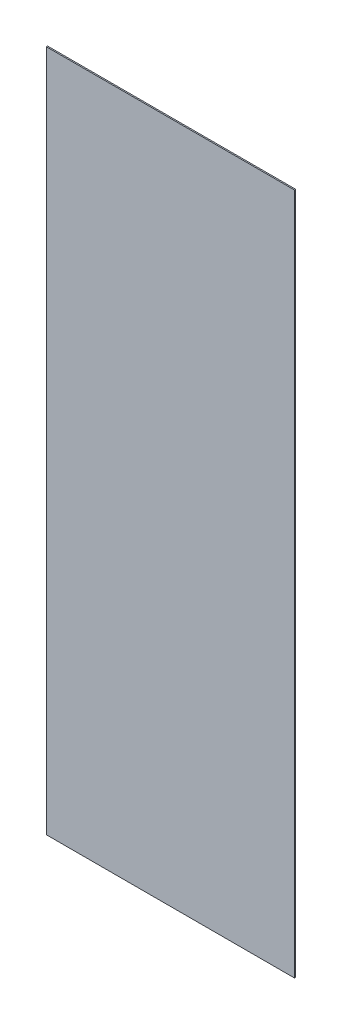
ISO-10303-21;
HEADER;
FILE_DESCRIPTION(('STEP AP214'),'2;1');
FILE_NAME('part.step','',(''),(''),'','','');
FILE_SCHEMA(('AUTOMOTIVE_DESIGN { 1 0 10303 214 1 1 1 1 }'));
ENDSEC;
DATA;
#1=APPLICATION_CONTEXT('core data for automotive mechanical design processes');
#2=APPLICATION_PROTOCOL_DEFINITION('international standard','automotive_design',2000,#1);
#3=PRODUCT_CONTEXT('',#1,'mechanical');
#4=PRODUCT('Part','Part','',(#3));
#5=PRODUCT_RELATED_PRODUCT_CATEGORY('part','',(#4));
#6=PRODUCT_DEFINITION_FORMATION('','',#4);
#7=PRODUCT_DEFINITION_CONTEXT('part definition',#1,'design');
#8=PRODUCT_DEFINITION('design','',#6,#7);
#9=PRODUCT_DEFINITION_SHAPE('','',#8);
#10=(LENGTH_UNIT() NAMED_UNIT(*) SI_UNIT(.MILLI.,.METRE.));
#11=(NAMED_UNIT(*) PLANE_ANGLE_UNIT() SI_UNIT($,.RADIAN.));
#12=(NAMED_UNIT(*) SI_UNIT($,.STERADIAN.) SOLID_ANGLE_UNIT());
#13=UNCERTAINTY_MEASURE_WITH_UNIT(LENGTH_MEASURE(1.E-05),#10,'distance_accuracy_value','');
#14=(GEOMETRIC_REPRESENTATION_CONTEXT(3) GLOBAL_UNCERTAINTY_ASSIGNED_CONTEXT((#13)) GLOBAL_UNIT_ASSIGNED_CONTEXT((#10,
#11,#12)) REPRESENTATION_CONTEXT('',''));
#15=CARTESIAN_POINT('',(0.,0.,0.));
#16=DIRECTION('',(0.,0.,1.));
#17=DIRECTION('',(1.,0.,0.));
#18=AXIS2_PLACEMENT_3D('',#15,#16,#17);
#19=CARTESIAN_POINT('',(2.5544535961954,-0.251849343952375,0.));
#20=DIRECTION('',(0.,1.,0.));
#21=DIRECTION('',(-1.,0.,0.));
#22=AXIS2_PLACEMENT_3D('',#19,#20,#21);
#23=PLANE('',#22);
#24=DIRECTION('',(1.,0.,0.));
#25=VECTOR('',#24,1.);
#26=CARTESIAN_POINT('',(2.5345236394027,-0.251849343952375,0.));
#27=LINE('',#26,#25);
#28=CARTESIAN_POINT('',(2.5345236394027,-0.251849343952375,0.));
#29=VERTEX_POINT('',#28);
#30=CARTESIAN_POINT('',(2.5544535961954,-0.251849343952375,0.));
#31=VERTEX_POINT('',#30);
#32=EDGE_CURVE('E11',#29,#31,#27,.T.);
#33=ORIENTED_EDGE('',*,*,#32,.F.);
#34=DIRECTION('',(0.,0.,1.));
#35=VECTOR('',#34,1.);
#36=CARTESIAN_POINT('',(2.5345236394027,-0.251849343952375,0.));
#37=LINE('',#36,#35);
#38=CARTESIAN_POINT('',(2.5345236394027,-0.251849343952375,0.0001));
#39=VERTEX_POINT('',#38);
#40=EDGE_CURVE('E24',#29,#39,#37,.T.);
#41=ORIENTED_EDGE('',*,*,#40,.T.);
#42=DIRECTION('',(-1.,0.,0.));
#43=VECTOR('',#42,1.);
#44=CARTESIAN_POINT('',(2.5345236394027,-0.251849343952375,0.0001));
#45=LINE('',#44,#43);
#46=CARTESIAN_POINT('',(2.5544535961954,-0.251849343952375,0.0001));
#47=VERTEX_POINT('',#46);
#48=EDGE_CURVE('E75',#47,#39,#45,.T.);
#49=ORIENTED_EDGE('',*,*,#48,.F.);
#50=DIRECTION('',(0.,0.,1.));
#51=VECTOR('',#50,1.);
#52=CARTESIAN_POINT('',(2.5544535961954,-0.251849343952375,0.));
#53=LINE('',#52,#51);
#54=EDGE_CURVE('E85',#31,#47,#53,.T.);
#55=ORIENTED_EDGE('',*,*,#54,.F.);
#56=EDGE_LOOP('',(#33,#41,#49,#55));
#57=FACE_BOUND('',#56,.T.);
#58=ADVANCED_FACE('F17',(#57),#23,.T.);
#59=CARTESIAN_POINT('',(2.5544535961954,-0.306666120864404,0.));
#60=DIRECTION('',(1.,0.,0.));
#61=DIRECTION('',(0.,1.,0.));
#62=AXIS2_PLACEMENT_3D('',#59,#60,#61);
#63=PLANE('',#62);
#64=DIRECTION('',(0.,-1.,0.));
#65=VECTOR('',#64,1.);
#66=CARTESIAN_POINT('',(2.5544535961954,-0.251849343952375,0.));
#67=LINE('',#66,#65);
#68=CARTESIAN_POINT('',(2.5544535961954,-0.306666120864404,0.));
#69=VERTEX_POINT('',#68);
#70=EDGE_CURVE('E83',#31,#69,#67,.T.);
#71=ORIENTED_EDGE('',*,*,#70,.F.);
#72=ORIENTED_EDGE('',*,*,#54,.T.);
#73=DIRECTION('',(0.,1.,0.));
#74=VECTOR('',#73,1.);
#75=CARTESIAN_POINT('',(2.5544535961954,-0.251849343952375,0.0001));
#76=LINE('',#75,#74);
#77=CARTESIAN_POINT('',(2.5544535961954,-0.306666120864404,0.0001));
#78=VERTEX_POINT('',#77);
#79=EDGE_CURVE('E81',#78,#47,#76,.T.);
#80=ORIENTED_EDGE('',*,*,#79,.F.);
#81=DIRECTION('',(0.,0.,1.));
#82=VECTOR('',#81,1.);
#83=CARTESIAN_POINT('',(2.5544535961954,-0.306666120864404,0.));
#84=LINE('',#83,#82);
#85=EDGE_CURVE('E61',#69,#78,#84,.T.);
#86=ORIENTED_EDGE('',*,*,#85,.F.);
#87=EDGE_LOOP('',(#71,#72,#80,#86));
#88=FACE_BOUND('',#87,.T.);
#89=ADVANCED_FACE('F91',(#88),#63,.T.);
#90=CARTESIAN_POINT('',(2.5345236394027,-0.306666120864404,0.));
#91=DIRECTION('',(0.,-1.,0.));
#92=DIRECTION('',(1.,0.,0.));
#93=AXIS2_PLACEMENT_3D('',#90,#91,#92);
#94=PLANE('',#93);
#95=DIRECTION('',(-1.,0.,0.));
#96=VECTOR('',#95,1.);
#97=CARTESIAN_POINT('',(2.5544535961954,-0.306666120864404,0.));
#98=LINE('',#97,#96);
#99=CARTESIAN_POINT('',(2.5345236394027,-0.306666120864404,0.));
#100=VERTEX_POINT('',#99);
#101=EDGE_CURVE('E65',#69,#100,#98,.T.);
#102=ORIENTED_EDGE('',*,*,#101,.F.);
#103=ORIENTED_EDGE('',*,*,#85,.T.);
#104=DIRECTION('',(1.,0.,0.));
#105=VECTOR('',#104,1.);
#106=CARTESIAN_POINT('',(2.5544535961954,-0.306666120864404,0.0001));
#107=LINE('',#106,#105);
#108=CARTESIAN_POINT('',(2.5345236394027,-0.306666120864404,0.0001));
#109=VERTEX_POINT('',#108);
#110=EDGE_CURVE('E54',#109,#78,#107,.T.);
#111=ORIENTED_EDGE('',*,*,#110,.F.);
#112=DIRECTION('',(0.,0.,1.));
#113=VECTOR('',#112,1.);
#114=CARTESIAN_POINT('',(2.5345236394027,-0.306666120864404,0.));
#115=LINE('',#114,#113);
#116=EDGE_CURVE('E58',#100,#109,#115,.T.);
#117=ORIENTED_EDGE('',*,*,#116,.F.);
#118=EDGE_LOOP('',(#102,#103,#111,#117));
#119=FACE_BOUND('',#118,.T.);
#120=ADVANCED_FACE('F57',(#119),#94,.T.);
#121=CARTESIAN_POINT('',(2.5345236394027,-0.251849343952375,0.));
#122=DIRECTION('',(-1.,0.,0.));
#123=DIRECTION('',(0.,-1.,0.));
#124=AXIS2_PLACEMENT_3D('',#121,#122,#123);
#125=PLANE('',#124);
#126=DIRECTION('',(0.,1.,0.));
#127=VECTOR('',#126,1.);
#128=CARTESIAN_POINT('',(2.5345236394027,-0.306666120864404,0.));
#129=LINE('',#128,#127);
#130=EDGE_CURVE('E71',#100,#29,#129,.T.);
#131=ORIENTED_EDGE('',*,*,#130,.F.);
#132=ORIENTED_EDGE('',*,*,#116,.T.);
#133=DIRECTION('',(0.,-1.,0.));
#134=VECTOR('',#133,1.);
#135=CARTESIAN_POINT('',(2.5345236394027,-0.306666120864404,0.0001));
#136=LINE('',#135,#134);
#137=EDGE_CURVE('E70',#39,#109,#136,.T.);
#138=ORIENTED_EDGE('',*,*,#137,.F.);
#139=ORIENTED_EDGE('',*,*,#40,.F.);
#140=EDGE_LOOP('',(#131,#132,#138,#139));
#141=FACE_BOUND('',#140,.T.);
#142=ADVANCED_FACE('F69',(#141),#125,.T.);
#143=CARTESIAN_POINT('',(2.544488617799,-0.27925773240839,0.));
#144=DIRECTION('',(0.,0.,1.));
#145=DIRECTION('',(1.,0.,0.));
#146=AXIS2_PLACEMENT_3D('',#143,#144,#145);
#147=PLANE('',#146);
#148=ORIENTED_EDGE('',*,*,#130,.T.);
#149=ORIENTED_EDGE('',*,*,#32,.T.);
#150=ORIENTED_EDGE('',*,*,#70,.T.);
#151=ORIENTED_EDGE('',*,*,#101,.T.);
#152=EDGE_LOOP('',(#148,#149,#150,#151));
#153=FACE_BOUND('',#152,.T.);
#154=ADVANCED_FACE('F88',(#153),#147,.F.);
#155=CARTESIAN_POINT('',(2.544488617799,-0.27925773240839,0.0001));
#156=DIRECTION('',(0.,0.,1.));
#157=DIRECTION('',(1.,0.,0.));
#158=AXIS2_PLACEMENT_3D('',#155,#156,#157);
#159=PLANE('',#158);
#160=ORIENTED_EDGE('',*,*,#137,.T.);
#161=ORIENTED_EDGE('',*,*,#110,.T.);
#162=ORIENTED_EDGE('',*,*,#79,.T.);
#163=ORIENTED_EDGE('',*,*,#48,.T.);
#164=EDGE_LOOP('',(#160,#161,#162,#163));
#165=FACE_BOUND('',#164,.T.);
#166=ADVANCED_FACE('F74',(#165),#159,.T.);
#167=CLOSED_SHELL('',(#58,#89,#120,#142,#154,#166));
#168=MANIFOLD_SOLID_BREP('B1',#167);
#169=ADVANCED_BREP_SHAPE_REPRESENTATION('',(#18,#168),#14);
#170=SHAPE_DEFINITION_REPRESENTATION(#9,#169);
ENDSEC;
END-ISO-10303-21;
